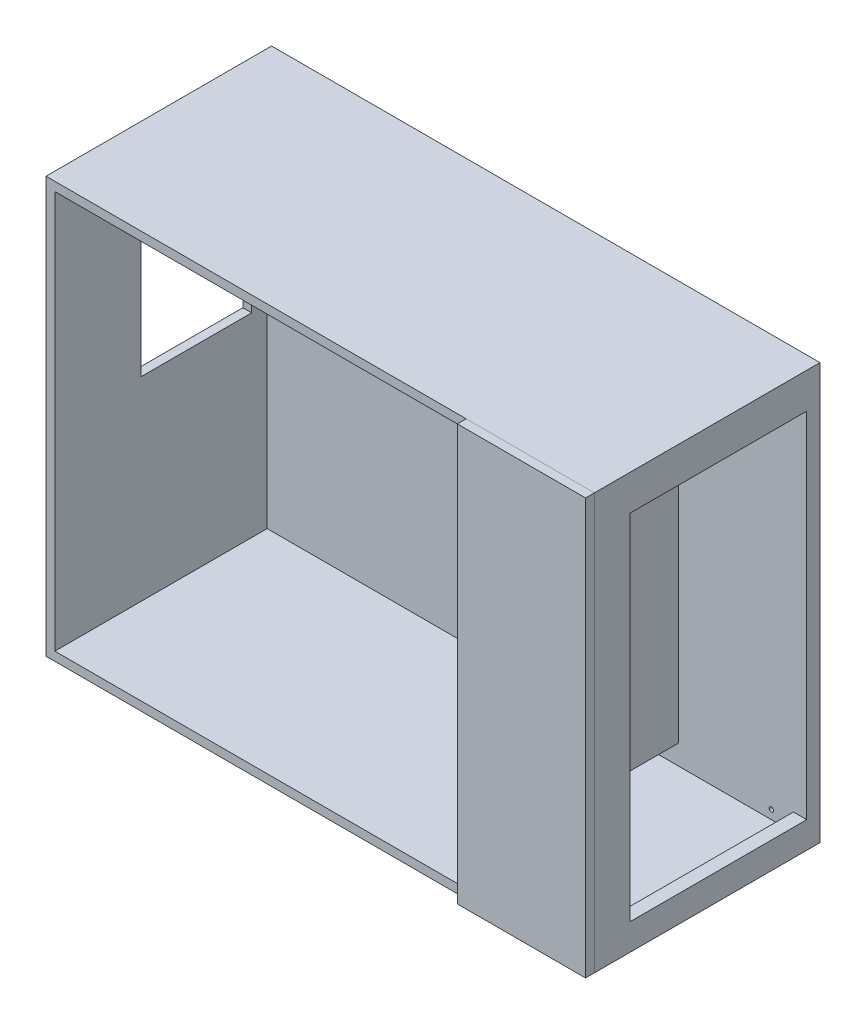
ISO-10303-21;
HEADER;
FILE_DESCRIPTION(('STEP AP214'),'2;1');
FILE_NAME('part.step','',(''),(''),'','','');
FILE_SCHEMA(('AUTOMOTIVE_DESIGN { 1 0 10303 214 1 1 1 1 }'));
ENDSEC;
DATA;
#1=APPLICATION_CONTEXT('core data for automotive mechanical design processes');
#2=APPLICATION_PROTOCOL_DEFINITION('international standard','automotive_design',2000,#1);
#3=PRODUCT_CONTEXT('',#1,'mechanical');
#4=PRODUCT('Part','Part','',(#3));
#5=PRODUCT_RELATED_PRODUCT_CATEGORY('part','',(#4));
#6=PRODUCT_DEFINITION_FORMATION('','',#4);
#7=PRODUCT_DEFINITION_CONTEXT('part definition',#1,'design');
#8=PRODUCT_DEFINITION('design','',#6,#7);
#9=PRODUCT_DEFINITION_SHAPE('','',#8);
#10=(LENGTH_UNIT() NAMED_UNIT(*) SI_UNIT(.MILLI.,.METRE.));
#11=(NAMED_UNIT(*) PLANE_ANGLE_UNIT() SI_UNIT($,.RADIAN.));
#12=(NAMED_UNIT(*) SI_UNIT($,.STERADIAN.) SOLID_ANGLE_UNIT());
#13=UNCERTAINTY_MEASURE_WITH_UNIT(LENGTH_MEASURE(1.E-05),#10,'distance_accuracy_value','');
#14=(GEOMETRIC_REPRESENTATION_CONTEXT(3) GLOBAL_UNCERTAINTY_ASSIGNED_CONTEXT((#13)) GLOBAL_UNIT_ASSIGNED_CONTEXT((#10,
#11,#12)) REPRESENTATION_CONTEXT('',''));
#15=CARTESIAN_POINT('',(0.,0.,0.));
#16=DIRECTION('',(0.,0.,1.));
#17=DIRECTION('',(1.,0.,0.));
#18=AXIS2_PLACEMENT_3D('',#15,#16,#17);
#19=CARTESIAN_POINT('',(300.,1200.,275.));
#20=DIRECTION('',(1.,0.,0.));
#21=DIRECTION('',(0.,1.,0.));
#22=AXIS2_PLACEMENT_3D('',#19,#20,#21);
#23=PLANE('',#22);
#24=DIRECTION('',(0.,-1.,0.));
#25=VECTOR('',#24,1.);
#26=CARTESIAN_POINT('',(300.,1200.,275.));
#27=LINE('',#26,#25);
#28=CARTESIAN_POINT('',(300.,1030.,275.));
#29=VERTEX_POINT('',#28);
#30=CARTESIAN_POINT('',(300.,90.,275.));
#31=VERTEX_POINT('',#30);
#32=EDGE_CURVE('E98',#29,#31,#27,.T.);
#33=ORIENTED_EDGE('',*,*,#32,.F.);
#34=DIRECTION('',(0.,0.,1.));
#35=VECTOR('',#34,1.);
#36=CARTESIAN_POINT('',(300.,1030.,-1165.));
#37=LINE('',#36,#35);
#38=CARTESIAN_POINT('',(300.,1030.,255.));
#39=VERTEX_POINT('',#38);
#40=EDGE_CURVE('E85',#39,#29,#37,.T.);
#41=ORIENTED_EDGE('',*,*,#40,.F.);
#42=DIRECTION('',(0.,-1.,0.));
#43=VECTOR('',#42,1.);
#44=CARTESIAN_POINT('',(300.,1200.,255.));
#45=LINE('',#44,#43);
#46=CARTESIAN_POINT('',(300.,90.,255.));
#47=VERTEX_POINT('',#46);
#48=EDGE_CURVE('E104',#39,#47,#45,.T.);
#49=ORIENTED_EDGE('',*,*,#48,.T.);
#50=DIRECTION('',(0.,0.,1.));
#51=VECTOR('',#50,1.);
#52=CARTESIAN_POINT('',(300.,90.,-1165.));
#53=LINE('',#52,#51);
#54=EDGE_CURVE('E103',#47,#31,#53,.T.);
#55=ORIENTED_EDGE('',*,*,#54,.T.);
#56=EDGE_LOOP('',(#33,#41,#49,#55));
#57=FACE_BOUND('',#56,.T.);
#58=ADVANCED_FACE('F46',(#57),#23,.F.);
#59=CARTESIAN_POINT('',(0.,0.,275.));
#60=DIRECTION('',(0.,0.,-1.));
#61=DIRECTION('',(-1.,0.,0.));
#62=AXIS2_PLACEMENT_3D('',#59,#60,#61);
#63=PLANE('',#62);
#64=DIRECTION('',(0.,-1.,0.));
#65=VECTOR('',#64,1.);
#66=CARTESIAN_POINT('',(590.,0.,275.));
#67=LINE('',#66,#65);
#68=CARTESIAN_POINT('',(590.,1030.,275.));
#69=VERTEX_POINT('',#68);
#70=CARTESIAN_POINT('',(590.,90.,275.));
#71=VERTEX_POINT('',#70);
#72=EDGE_CURVE('E100',#69,#71,#67,.T.);
#73=ORIENTED_EDGE('',*,*,#72,.F.);
#74=DIRECTION('',(1.,0.,0.));
#75=VECTOR('',#74,1.);
#76=CARTESIAN_POINT('',(300.,1030.,275.));
#77=LINE('',#76,#75);
#78=EDGE_CURVE('E60',#29,#69,#77,.T.);
#79=ORIENTED_EDGE('',*,*,#78,.F.);
#80=ORIENTED_EDGE('',*,*,#32,.T.);
#81=DIRECTION('',(-1.,0.,0.));
#82=VECTOR('',#81,1.);
#83=CARTESIAN_POINT('',(300.,90.,275.));
#84=LINE('',#83,#82);
#85=EDGE_CURVE('E112',#71,#31,#84,.T.);
#86=ORIENTED_EDGE('',*,*,#85,.F.);
#87=EDGE_LOOP('',(#73,#79,#80,#86));
#88=FACE_BOUND('',#87,.T.);
#89=ADVANCED_FACE('F96',(#88),#63,.F.);
#90=CARTESIAN_POINT('',(0.,0.,255.));
#91=DIRECTION('',(0.,0.,-1.));
#92=DIRECTION('',(-1.,0.,0.));
#93=AXIS2_PLACEMENT_3D('',#90,#91,#92);
#94=PLANE('',#93);
#95=DIRECTION('',(-1.,0.,0.));
#96=VECTOR('',#95,1.);
#97=CARTESIAN_POINT('',(-1.57728236601919E-12,1030.,255.));
#98=LINE('',#97,#96);
#99=CARTESIAN_POINT('',(590.,1030.,255.));
#100=VERTEX_POINT('',#99);
#101=EDGE_CURVE('E88',#100,#39,#98,.T.);
#102=ORIENTED_EDGE('',*,*,#101,.F.);
#103=DIRECTION('',(0.,1.,0.));
#104=VECTOR('',#103,1.);
#105=CARTESIAN_POINT('',(590.,0.,255.));
#106=LINE('',#105,#104);
#107=CARTESIAN_POINT('',(590.,90.,255.));
#108=VERTEX_POINT('',#107);
#109=EDGE_CURVE('E53',#108,#100,#106,.T.);
#110=ORIENTED_EDGE('',*,*,#109,.F.);
#111=DIRECTION('',(1.,0.,0.));
#112=VECTOR('',#111,1.);
#113=CARTESIAN_POINT('',(0.,90.,255.));
#114=LINE('',#113,#112);
#115=EDGE_CURVE('E68',#47,#108,#114,.T.);
#116=ORIENTED_EDGE('',*,*,#115,.F.);
#117=ORIENTED_EDGE('',*,*,#48,.F.);
#118=EDGE_LOOP('',(#102,#110,#116,#117));
#119=FACE_BOUND('',#118,.T.);
#120=ADVANCED_FACE('F119',(#119),#94,.T.);
#121=CARTESIAN_POINT('',(590.,0.,-1165.));
#122=DIRECTION('',(-1.,0.,0.));
#123=DIRECTION('',(0.,-1.,0.));
#124=AXIS2_PLACEMENT_3D('',#121,#122,#123);
#125=PLANE('',#124);
#126=ORIENTED_EDGE('',*,*,#109,.T.);
#127=DIRECTION('',(0.,0.,1.));
#128=VECTOR('',#127,1.);
#129=CARTESIAN_POINT('',(590.,1030.,-1165.));
#130=LINE('',#129,#128);
#131=EDGE_CURVE('E92',#100,#69,#130,.T.);
#132=ORIENTED_EDGE('',*,*,#131,.T.);
#133=ORIENTED_EDGE('',*,*,#72,.T.);
#134=DIRECTION('',(0.,0.,-1.));
#135=VECTOR('',#134,1.);
#136=CARTESIAN_POINT('',(590.,90.,-1165.));
#137=LINE('',#136,#135);
#138=EDGE_CURVE('E12',#71,#108,#137,.T.);
#139=ORIENTED_EDGE('',*,*,#138,.T.);
#140=EDGE_LOOP('',(#126,#132,#133,#139));
#141=FACE_BOUND('',#140,.T.);
#142=ADVANCED_FACE('F116',(#141),#125,.F.);
#143=CARTESIAN_POINT('',(300.,90.,-1165.));
#144=DIRECTION('',(0.,1.,0.));
#145=DIRECTION('',(0.,0.,1.));
#146=AXIS2_PLACEMENT_3D('',#143,#144,#145);
#147=PLANE('',#146);
#148=ORIENTED_EDGE('',*,*,#115,.T.);
#149=ORIENTED_EDGE('',*,*,#138,.F.);
#150=ORIENTED_EDGE('',*,*,#85,.T.);
#151=ORIENTED_EDGE('',*,*,#54,.F.);
#152=EDGE_LOOP('',(#148,#149,#150,#151));
#153=FACE_BOUND('',#152,.T.);
#154=ADVANCED_FACE('F120',(#153),#147,.F.);
#155=CARTESIAN_POINT('',(300.,1030.,-1165.));
#156=DIRECTION('',(0.,-1.,0.));
#157=DIRECTION('',(1.,0.,0.));
#158=AXIS2_PLACEMENT_3D('',#155,#156,#157);
#159=PLANE('',#158);
#160=ORIENTED_EDGE('',*,*,#101,.T.);
#161=ORIENTED_EDGE('',*,*,#40,.T.);
#162=ORIENTED_EDGE('',*,*,#78,.T.);
#163=ORIENTED_EDGE('',*,*,#131,.F.);
#164=EDGE_LOOP('',(#160,#161,#162,#163));
#165=FACE_BOUND('',#164,.T.);
#166=ADVANCED_FACE('F86',(#165),#159,.F.);
#167=CLOSED_SHELL('',(#58,#89,#120,#142,#154,#166));
#168=MANIFOLD_SOLID_BREP('B2',#167);
#169=CARTESIAN_POINT('',(-650.,1200.,255.));
#170=DIRECTION('',(1.,0.,0.));
#171=DIRECTION('',(0.,0.,-1.));
#172=AXIS2_PLACEMENT_3D('',#169,#170,#171);
#173=PLANE('',#172);
#174=DIRECTION('',(0.,0.,-1.));
#175=VECTOR('',#174,1.);
#176=CARTESIAN_POINT('',(-650.,950.,59.9999999999999));
#177=LINE('',#176,#175);
#178=CARTESIAN_POINT('',(-650.,950.,59.9999999999999));
#179=VERTEX_POINT('',#178);
#180=CARTESIAN_POINT('',(-650.,950.,-190.));
#181=VERTEX_POINT('',#180);
#182=EDGE_CURVE('E442',#179,#181,#177,.T.);
#183=ORIENTED_EDGE('',*,*,#182,.F.);
#184=DIRECTION('',(0.,1.,0.));
#185=VECTOR('',#184,1.);
#186=CARTESIAN_POINT('',(-650.,950.,59.9999999999999));
#187=LINE('',#186,#185);
#188=CARTESIAN_POINT('',(-650.,550.,60.));
#189=VERTEX_POINT('',#188);
#190=EDGE_CURVE('E435',#189,#179,#187,.T.);
#191=ORIENTED_EDGE('',*,*,#190,.F.);
#192=DIRECTION('',(0.,0.,1.));
#193=VECTOR('',#192,1.);
#194=CARTESIAN_POINT('',(-650.,550.,60.));
#195=LINE('',#194,#193);
#196=CARTESIAN_POINT('',(-650.,550.,-190.));
#197=VERTEX_POINT('',#196);
#198=EDGE_CURVE('E448',#197,#189,#195,.T.);
#199=ORIENTED_EDGE('',*,*,#198,.F.);
#200=DIRECTION('',(0.,-1.,0.));
#201=VECTOR('',#200,1.);
#202=CARTESIAN_POINT('',(-650.,950.,-190.));
#203=LINE('',#202,#201);
#204=EDGE_CURVE('E445',#181,#197,#203,.T.);
#205=ORIENTED_EDGE('',*,*,#204,.F.);
#206=EDGE_LOOP('',(#183,#191,#199,#205));
#207=FACE_BOUND('',#206,.T.);
#208=DIRECTION('',(0.,-1.,0.));
#209=VECTOR('',#208,1.);
#210=CARTESIAN_POINT('',(-650.,1200.,255.));
#211=LINE('',#210,#209);
#212=CARTESIAN_POINT('',(-650.,1030.,255.));
#213=VERTEX_POINT('',#212);
#214=CARTESIAN_POINT('',(-650.,90.,255.));
#215=VERTEX_POINT('',#214);
#216=EDGE_CURVE('E331',#213,#215,#211,.T.);
#217=ORIENTED_EDGE('',*,*,#216,.F.);
#218=DIRECTION('',(0.,0.,1.));
#219=VECTOR('',#218,1.);
#220=CARTESIAN_POINT('',(-650.,1030.,-1185.));
#221=LINE('',#220,#219);
#222=CARTESIAN_POINT('',(-650.,1030.,-255.));
#223=VERTEX_POINT('',#222);
#224=EDGE_CURVE('E319',#223,#213,#221,.T.);
#225=ORIENTED_EDGE('',*,*,#224,.F.);
#226=DIRECTION('',(0.,-1.,0.));
#227=VECTOR('',#226,1.);
#228=CARTESIAN_POINT('',(-650.,1200.,-255.));
#229=LINE('',#228,#227);
#230=CARTESIAN_POINT('',(-650.,90.0000000000001,-255.));
#231=VERTEX_POINT('',#230);
#232=EDGE_CURVE('E340',#223,#231,#229,.T.);
#233=ORIENTED_EDGE('',*,*,#232,.T.);
#234=DIRECTION('',(0.,0.,-1.));
#235=VECTOR('',#234,1.);
#236=CARTESIAN_POINT('',(-650.,90.,-255.));
#237=LINE('',#236,#235);
#238=EDGE_CURVE('E338',#215,#231,#237,.T.);
#239=ORIENTED_EDGE('',*,*,#238,.F.);
#240=EDGE_LOOP('',(#217,#225,#233,#239));
#241=FACE_BOUND('',#240,.T.);
#242=ADVANCED_FACE('F174',(#207,#241),#173,.F.);
#243=CARTESIAN_POINT('',(-650.,1200.,255.));
#244=DIRECTION('',(0.,0.,-1.));
#245=DIRECTION('',(-1.,0.,0.));
#246=AXIS2_PLACEMENT_3D('',#243,#244,#245);
#247=PLANE('',#246);
#248=DIRECTION('',(1.,0.,0.));
#249=VECTOR('',#248,1.);
#250=CARTESIAN_POINT('',(560.,110.,255.));
#251=LINE('',#250,#249);
#252=CARTESIAN_POINT('',(300.,110.,255.));
#253=VERTEX_POINT('',#252);
#254=CARTESIAN_POINT('',(560.,110.,255.));
#255=VERTEX_POINT('',#254);
#256=EDGE_CURVE('E425',#253,#255,#251,.T.);
#257=ORIENTED_EDGE('',*,*,#256,.F.);
#258=DIRECTION('',(0.,-1.,0.));
#259=VECTOR('',#258,1.);
#260=CARTESIAN_POINT('',(300.,110.,255.));
#261=LINE('',#260,#259);
#262=CARTESIAN_POINT('',(300.,1010.,255.));
#263=VERTEX_POINT('',#262);
#264=EDGE_CURVE('E410',#263,#253,#261,.T.);
#265=ORIENTED_EDGE('',*,*,#264,.F.);
#266=DIRECTION('',(-1.,0.,0.));
#267=VECTOR('',#266,1.);
#268=CARTESIAN_POINT('',(560.,1010.,255.));
#269=LINE('',#268,#267);
#270=CARTESIAN_POINT('',(560.,1010.,255.));
#271=VERTEX_POINT('',#270);
#272=EDGE_CURVE('E415',#271,#263,#269,.T.);
#273=ORIENTED_EDGE('',*,*,#272,.F.);
#274=DIRECTION('',(0.,1.,0.));
#275=VECTOR('',#274,1.);
#276=CARTESIAN_POINT('',(560.,110.,255.));
#277=LINE('',#276,#275);
#278=EDGE_CURVE('E428',#255,#271,#277,.T.);
#279=ORIENTED_EDGE('',*,*,#278,.F.);
#280=EDGE_LOOP('',(#257,#265,#273,#279));
#281=FACE_BOUND('',#280,.T.);
#282=DIRECTION('',(0.,1.,0.));
#283=VECTOR('',#282,1.);
#284=CARTESIAN_POINT('',(280.,0.,255.));
#285=LINE('',#284,#283);
#286=CARTESIAN_POINT('',(280.,110.,255.));
#287=VERTEX_POINT('',#286);
#288=CARTESIAN_POINT('',(280.,1010.,255.));
#289=VERTEX_POINT('',#288);
#290=EDGE_CURVE('E475',#287,#289,#285,.T.);
#291=ORIENTED_EDGE('',*,*,#290,.F.);
#292=DIRECTION('',(1.,0.,0.));
#293=VECTOR('',#292,1.);
#294=CARTESIAN_POINT('',(0.,110.,255.));
#295=LINE('',#294,#293);
#296=CARTESIAN_POINT('',(-630.,110.,255.));
#297=VERTEX_POINT('',#296);
#298=EDGE_CURVE('E454',#297,#287,#295,.T.);
#299=ORIENTED_EDGE('',*,*,#298,.F.);
#300=DIRECTION('',(0.,-1.,0.));
#301=VECTOR('',#300,1.);
#302=CARTESIAN_POINT('',(-630.,0.,255.));
#303=LINE('',#302,#301);
#304=CARTESIAN_POINT('',(-630.,1010.,255.));
#305=VERTEX_POINT('',#304);
#306=EDGE_CURVE('E464',#305,#297,#303,.T.);
#307=ORIENTED_EDGE('',*,*,#306,.F.);
#308=DIRECTION('',(1.,0.,0.));
#309=VECTOR('',#308,1.);
#310=CARTESIAN_POINT('',(0.,1010.,255.));
#311=LINE('',#310,#309);
#312=EDGE_CURVE('E478',#305,#289,#311,.T.);
#313=ORIENTED_EDGE('',*,*,#312,.T.);
#314=EDGE_LOOP('',(#291,#299,#307,#313));
#315=FACE_BOUND('',#314,.T.);
#316=DIRECTION('',(0.,1.,0.));
#317=VECTOR('',#316,1.);
#318=CARTESIAN_POINT('',(590.,1200.,255.));
#319=LINE('',#318,#317);
#320=CARTESIAN_POINT('',(590.,90.,255.));
#321=VERTEX_POINT('',#320);
#322=CARTESIAN_POINT('',(590.,1030.,255.));
#323=VERTEX_POINT('',#322);
#324=EDGE_CURVE('E333',#321,#323,#319,.T.);
#325=ORIENTED_EDGE('',*,*,#324,.T.);
#326=DIRECTION('',(1.,0.,0.));
#327=VECTOR('',#326,1.);
#328=CARTESIAN_POINT('',(-650.,1030.,255.));
#329=LINE('',#328,#327);
#330=EDGE_CURVE('E188',#213,#323,#329,.T.);
#331=ORIENTED_EDGE('',*,*,#330,.F.);
#332=ORIENTED_EDGE('',*,*,#216,.T.);
#333=DIRECTION('',(-1.,0.,0.));
#334=VECTOR('',#333,1.);
#335=CARTESIAN_POINT('',(790.000000000001,90.,255.));
#336=LINE('',#335,#334);
#337=EDGE_CURVE('E364',#321,#215,#336,.T.);
#338=ORIENTED_EDGE('',*,*,#337,.F.);
#339=EDGE_LOOP('',(#325,#331,#332,#338));
#340=FACE_BOUND('',#339,.T.);
#341=ADVANCED_FACE('F329',(#281,#315,#340),#247,.F.);
#342=CARTESIAN_POINT('',(-650.,1200.,-255.));
#343=DIRECTION('',(0.,0.,1.));
#344=DIRECTION('',(1.,0.,0.));
#345=AXIS2_PLACEMENT_3D('',#342,#343,#344);
#346=PLANE('',#345);
#347=CARTESIAN_POINT('',(510.,130.,-255.));
#348=DIRECTION('',(0.,0.,-1.));
#349=DIRECTION('',(-1.,0.,0.));
#350=AXIS2_PLACEMENT_3D('',#347,#348,#349);
#351=CIRCLE('',#350,5.00000000000005);
#352=CARTESIAN_POINT('',(505.,130.,-255.));
#353=VERTEX_POINT('',#352);
#354=EDGE_CURVE('E586',#353,#353,#351,.T.);
#355=ORIENTED_EDGE('',*,*,#354,.F.);
#356=EDGE_LOOP('',(#355));
#357=FACE_BOUND('',#356,.T.);
#358=ORIENTED_EDGE('',*,*,#232,.F.);
#359=DIRECTION('',(1.,0.,0.));
#360=VECTOR('',#359,1.);
#361=CARTESIAN_POINT('',(-650.,1030.,-255.));
#362=LINE('',#361,#360);
#363=CARTESIAN_POINT('',(590.,1030.,-255.));
#364=VERTEX_POINT('',#363);
#365=EDGE_CURVE('E322',#223,#364,#362,.T.);
#366=ORIENTED_EDGE('',*,*,#365,.T.);
#367=DIRECTION('',(0.,-1.,0.));
#368=VECTOR('',#367,1.);
#369=CARTESIAN_POINT('',(590.,1200.,-255.));
#370=LINE('',#369,#368);
#371=CARTESIAN_POINT('',(590.,90.,-255.));
#372=VERTEX_POINT('',#371);
#373=EDGE_CURVE('E592',#364,#372,#370,.T.);
#374=ORIENTED_EDGE('',*,*,#373,.T.);
#375=DIRECTION('',(-1.,0.,0.));
#376=VECTOR('',#375,1.);
#377=CARTESIAN_POINT('',(790.000000000001,90.,-255.));
#378=LINE('',#377,#376);
#379=EDGE_CURVE('E366',#372,#231,#378,.T.);
#380=ORIENTED_EDGE('',*,*,#379,.T.);
#381=EDGE_LOOP('',(#358,#366,#374,#380));
#382=FACE_BOUND('',#381,.T.);
#383=ADVANCED_FACE('F541',(#357,#382),#346,.F.);
#384=CARTESIAN_POINT('',(0.,110.,-225.));
#385=DIRECTION('',(0.,-1.,0.));
#386=DIRECTION('',(0.,0.,-1.));
#387=AXIS2_PLACEMENT_3D('',#384,#385,#386);
#388=PLANE('',#387);
#389=ORIENTED_EDGE('',*,*,#298,.T.);
#390=DIRECTION('',(0.,0.,1.));
#391=VECTOR('',#390,1.);
#392=CARTESIAN_POINT('',(280.,110.,-225.));
#393=LINE('',#392,#391);
#394=CARTESIAN_POINT('',(280.,110.,-94.9999999999996));
#395=VERTEX_POINT('',#394);
#396=EDGE_CURVE('E472',#395,#287,#393,.T.);
#397=ORIENTED_EDGE('',*,*,#396,.F.);
#398=DIRECTION('',(-1.,0.,0.));
#399=VECTOR('',#398,1.);
#400=CARTESIAN_POINT('',(510.,110.,-94.9999999999996));
#401=LINE('',#400,#399);
#402=CARTESIAN_POINT('',(300.,110.,-94.9999999999996));
#403=VERTEX_POINT('',#402);
#404=EDGE_CURVE('E380',#403,#395,#401,.T.);
#405=ORIENTED_EDGE('',*,*,#404,.F.);
#406=DIRECTION('',(0.,0.,1.));
#407=VECTOR('',#406,1.);
#408=CARTESIAN_POINT('',(300.,110.,-225.));
#409=LINE('',#408,#407);
#410=EDGE_CURVE('E422',#403,#253,#409,.T.);
#411=ORIENTED_EDGE('',*,*,#410,.T.);
#412=ORIENTED_EDGE('',*,*,#256,.T.);
#413=DIRECTION('',(0.,0.,1.));
#414=VECTOR('',#413,1.);
#415=CARTESIAN_POINT('',(560.,110.,-225.));
#416=LINE('',#415,#414);
#417=CARTESIAN_POINT('',(560.,110.,-225.));
#418=VERTEX_POINT('',#417);
#419=EDGE_CURVE('E438',#418,#255,#416,.T.);
#420=ORIENTED_EDGE('',*,*,#419,.F.);
#421=DIRECTION('',(1.,0.,0.));
#422=VECTOR('',#421,1.);
#423=CARTESIAN_POINT('',(0.,110.,-225.));
#424=LINE('',#423,#422);
#425=CARTESIAN_POINT('',(-630.,110.,-225.));
#426=VERTEX_POINT('',#425);
#427=EDGE_CURVE('E461',#426,#418,#424,.T.);
#428=ORIENTED_EDGE('',*,*,#427,.F.);
#429=DIRECTION('',(0.,0.,1.));
#430=VECTOR('',#429,1.);
#431=CARTESIAN_POINT('',(-630.,110.,-225.));
#432=LINE('',#431,#430);
#433=EDGE_CURVE('E345',#426,#297,#432,.T.);
#434=ORIENTED_EDGE('',*,*,#433,.T.);
#435=EDGE_LOOP('',(#389,#397,#405,#411,#412,#420,#428,#434));
#436=FACE_BOUND('',#435,.T.);
#437=ADVANCED_FACE('F497',(#436),#388,.F.);
#438=CARTESIAN_POINT('',(-630.,0.,-225.));
#439=DIRECTION('',(-1.,0.,0.));
#440=DIRECTION('',(0.,-1.,0.));
#441=AXIS2_PLACEMENT_3D('',#438,#439,#440);
#442=PLANE('',#441);
#443=DIRECTION('',(0.,0.,1.));
#444=VECTOR('',#443,1.);
#445=CARTESIAN_POINT('',(-630.,550.,-225.));
#446=LINE('',#445,#444);
#447=CARTESIAN_POINT('',(-630.,550.,-190.));
#448=VERTEX_POINT('',#447);
#449=CARTESIAN_POINT('',(-630.,550.,60.));
#450=VERTEX_POINT('',#449);
#451=EDGE_CURVE('E351',#448,#450,#446,.T.);
#452=ORIENTED_EDGE('',*,*,#451,.T.);
#453=DIRECTION('',(0.,1.,0.));
#454=VECTOR('',#453,1.);
#455=CARTESIAN_POINT('',(-630.,0.,60.0000000000001));
#456=LINE('',#455,#454);
#457=CARTESIAN_POINT('',(-630.,950.,59.9999999999999));
#458=VERTEX_POINT('',#457);
#459=EDGE_CURVE('E354',#450,#458,#456,.T.);
#460=ORIENTED_EDGE('',*,*,#459,.T.);
#461=DIRECTION('',(0.,0.,-1.));
#462=VECTOR('',#461,1.);
#463=CARTESIAN_POINT('',(-630.,950.,-225.));
#464=LINE('',#463,#462);
#465=CARTESIAN_POINT('',(-630.,950.,-190.));
#466=VERTEX_POINT('',#465);
#467=EDGE_CURVE('E339',#458,#466,#464,.T.);
#468=ORIENTED_EDGE('',*,*,#467,.T.);
#469=DIRECTION('',(0.,-1.,0.));
#470=VECTOR('',#469,1.);
#471=CARTESIAN_POINT('',(-630.,0.,-190.));
#472=LINE('',#471,#470);
#473=EDGE_CURVE('E343',#466,#448,#472,.T.);
#474=ORIENTED_EDGE('',*,*,#473,.T.);
#475=EDGE_LOOP('',(#452,#460,#468,#474));
#476=FACE_BOUND('',#475,.T.);
#477=ORIENTED_EDGE('',*,*,#306,.T.);
#478=ORIENTED_EDGE('',*,*,#433,.F.);
#479=DIRECTION('',(0.,-1.,0.));
#480=VECTOR('',#479,1.);
#481=CARTESIAN_POINT('',(-630.,0.,-225.));
#482=LINE('',#481,#480);
#483=CARTESIAN_POINT('',(-630.,1010.,-225.));
#484=VERTEX_POINT('',#483);
#485=EDGE_CURVE('E469',#484,#426,#482,.T.);
#486=ORIENTED_EDGE('',*,*,#485,.F.);
#487=DIRECTION('',(0.,0.,1.));
#488=VECTOR('',#487,1.);
#489=CARTESIAN_POINT('',(-630.,1010.,-225.));
#490=LINE('',#489,#488);
#491=EDGE_CURVE('E484',#484,#305,#490,.T.);
#492=ORIENTED_EDGE('',*,*,#491,.T.);
#493=EDGE_LOOP('',(#477,#478,#486,#492));
#494=FACE_BOUND('',#493,.T.);
#495=ADVANCED_FACE('F532',(#476,#494),#442,.F.);
#496=CARTESIAN_POINT('',(0.,1010.,-225.));
#497=DIRECTION('',(0.,-1.,0.));
#498=DIRECTION('',(0.,0.,-1.));
#499=AXIS2_PLACEMENT_3D('',#496,#497,#498);
#500=PLANE('',#499);
#501=ORIENTED_EDGE('',*,*,#312,.F.);
#502=ORIENTED_EDGE('',*,*,#491,.F.);
#503=DIRECTION('',(1.,0.,0.));
#504=VECTOR('',#503,1.);
#505=CARTESIAN_POINT('',(0.,1010.,-225.));
#506=LINE('',#505,#504);
#507=CARTESIAN_POINT('',(280.,1010.,-225.));
#508=VERTEX_POINT('',#507);
#509=EDGE_CURVE('E466',#484,#508,#506,.T.);
#510=ORIENTED_EDGE('',*,*,#509,.T.);
#511=DIRECTION('',(0.,0.,1.));
#512=VECTOR('',#511,1.);
#513=CARTESIAN_POINT('',(280.,1010.,-225.));
#514=LINE('',#513,#512);
#515=EDGE_CURVE('E486',#508,#289,#514,.T.);
#516=ORIENTED_EDGE('',*,*,#515,.T.);
#517=EDGE_LOOP('',(#501,#502,#510,#516));
#518=FACE_BOUND('',#517,.T.);
#519=ADVANCED_FACE('F503',(#518),#500,.T.);
#520=CARTESIAN_POINT('',(280.,0.,-225.));
#521=DIRECTION('',(1.,0.,0.));
#522=DIRECTION('',(0.,0.,-1.));
#523=AXIS2_PLACEMENT_3D('',#520,#521,#522);
#524=PLANE('',#523);
#525=DIRECTION('',(0.,0.,-1.));
#526=VECTOR('',#525,1.);
#527=CARTESIAN_POINT('',(280.,155.,-225.));
#528=LINE('',#527,#526);
#529=CARTESIAN_POINT('',(280.,155.,-94.9999999999996));
#530=VERTEX_POINT('',#529);
#531=CARTESIAN_POINT('',(280.,155.,-225.));
#532=VERTEX_POINT('',#531);
#533=EDGE_CURVE('E377',#530,#532,#528,.T.);
#534=ORIENTED_EDGE('',*,*,#533,.F.);
#535=DIRECTION('',(0.,1.,0.));
#536=VECTOR('',#535,1.);
#537=CARTESIAN_POINT('',(280.,110.,-94.9999999999996));
#538=LINE('',#537,#536);
#539=EDGE_CURVE('E370',#395,#530,#538,.T.);
#540=ORIENTED_EDGE('',*,*,#539,.F.);
#541=ORIENTED_EDGE('',*,*,#396,.T.);
#542=ORIENTED_EDGE('',*,*,#290,.T.);
#543=ORIENTED_EDGE('',*,*,#515,.F.);
#544=DIRECTION('',(0.,1.,0.));
#545=VECTOR('',#544,1.);
#546=CARTESIAN_POINT('',(280.,0.,-225.));
#547=LINE('',#546,#545);
#548=EDGE_CURVE('E463',#532,#508,#547,.T.);
#549=ORIENTED_EDGE('',*,*,#548,.F.);
#550=EDGE_LOOP('',(#534,#540,#541,#542,#543,#549));
#551=FACE_BOUND('',#550,.T.);
#552=ADVANCED_FACE('F491',(#551),#524,.F.);
#553=CARTESIAN_POINT('',(0.,0.,-225.));
#554=DIRECTION('',(0.,0.,1.));
#555=DIRECTION('',(1.,0.,0.));
#556=AXIS2_PLACEMENT_3D('',#553,#554,#555);
#557=PLANE('',#556);
#558=CARTESIAN_POINT('',(510.,130.,-225.));
#559=DIRECTION('',(0.,0.,-1.));
#560=DIRECTION('',(-1.,0.,0.));
#561=AXIS2_PLACEMENT_3D('',#558,#559,#560);
#562=CIRCLE('',#561,5.00000000000005);
#563=CARTESIAN_POINT('',(505.,130.,-225.));
#564=VERTEX_POINT('',#563);
#565=EDGE_CURVE('E334',#564,#564,#562,.T.);
#566=ORIENTED_EDGE('',*,*,#565,.T.);
#567=EDGE_LOOP('',(#566));
#568=FACE_BOUND('',#567,.T.);
#569=DIRECTION('',(0.,-1.,0.));
#570=VECTOR('',#569,1.);
#571=CARTESIAN_POINT('',(590.,0.,-225.));
#572=LINE('',#571,#570);
#573=CARTESIAN_POINT('',(590.,950.,-225.));
#574=VERTEX_POINT('',#573);
#575=CARTESIAN_POINT('',(590.,150.,-225.));
#576=VERTEX_POINT('',#575);
#577=EDGE_CURVE('E598',#574,#576,#572,.T.);
#578=ORIENTED_EDGE('',*,*,#577,.F.);
#579=DIRECTION('',(1.,0.,0.));
#580=VECTOR('',#579,1.);
#581=CARTESIAN_POINT('',(330.,950.,-225.));
#582=LINE('',#581,#580);
#583=CARTESIAN_POINT('',(560.,950.,-225.));
#584=VERTEX_POINT('',#583);
#585=EDGE_CURVE('E392',#584,#574,#582,.T.);
#586=ORIENTED_EDGE('',*,*,#585,.F.);
#587=DIRECTION('',(0.,1.,0.));
#588=VECTOR('',#587,1.);
#589=CARTESIAN_POINT('',(560.,110.,-225.));
#590=LINE('',#589,#588);
#591=CARTESIAN_POINT('',(560.,1010.,-225.));
#592=VERTEX_POINT('',#591);
#593=EDGE_CURVE('E414',#584,#592,#590,.T.);
#594=ORIENTED_EDGE('',*,*,#593,.T.);
#595=DIRECTION('',(-1.,0.,0.));
#596=VECTOR('',#595,1.);
#597=CARTESIAN_POINT('',(560.,1010.,-225.));
#598=LINE('',#597,#596);
#599=CARTESIAN_POINT('',(300.,1010.,-225.));
#600=VERTEX_POINT('',#599);
#601=EDGE_CURVE('E419',#592,#600,#598,.T.);
#602=ORIENTED_EDGE('',*,*,#601,.T.);
#603=DIRECTION('',(0.,-1.,0.));
#604=VECTOR('',#603,1.);
#605=CARTESIAN_POINT('',(300.,110.,-225.));
#606=LINE('',#605,#604);
#607=CARTESIAN_POINT('',(300.,155.,-225.));
#608=VERTEX_POINT('',#607);
#609=EDGE_CURVE('E411',#600,#608,#606,.T.);
#610=ORIENTED_EDGE('',*,*,#609,.T.);
#611=DIRECTION('',(-1.,0.,0.));
#612=VECTOR('',#611,1.);
#613=CARTESIAN_POINT('',(510.,155.,-225.));
#614=LINE('',#613,#612);
#615=EDGE_CURVE('E383',#608,#532,#614,.T.);
#616=ORIENTED_EDGE('',*,*,#615,.T.);
#617=ORIENTED_EDGE('',*,*,#548,.T.);
#618=ORIENTED_EDGE('',*,*,#509,.F.);
#619=ORIENTED_EDGE('',*,*,#485,.T.);
#620=ORIENTED_EDGE('',*,*,#427,.T.);
#621=CARTESIAN_POINT('',(560.,150.,-225.));
#622=VERTEX_POINT('',#621);
#623=EDGE_CURVE('E416',#418,#622,#590,.T.);
#624=ORIENTED_EDGE('',*,*,#623,.T.);
#625=DIRECTION('',(1.,0.,0.));
#626=VECTOR('',#625,1.);
#627=CARTESIAN_POINT('',(330.,150.,-225.));
#628=LINE('',#627,#626);
#629=EDGE_CURVE('E393',#622,#576,#628,.T.);
#630=ORIENTED_EDGE('',*,*,#629,.T.);
#631=EDGE_LOOP('',(#578,#586,#594,#602,#610,#616,#617,#618,#619,#620,#624,#630));
#632=FACE_BOUND('',#631,.T.);
#633=ADVANCED_FACE('F508',(#568,#632),#557,.T.);
#634=CARTESIAN_POINT('',(-580.,950.,59.9999999999999));
#635=DIRECTION('',(0.,0.,1.));
#636=DIRECTION('',(1.,0.,0.));
#637=AXIS2_PLACEMENT_3D('',#634,#635,#636);
#638=PLANE('',#637);
#639=DIRECTION('',(-1.,0.,0.));
#640=VECTOR('',#639,1.);
#641=CARTESIAN_POINT('',(-580.,550.,60.));
#642=LINE('',#641,#640);
#643=EDGE_CURVE('E452',#450,#189,#642,.T.);
#644=ORIENTED_EDGE('',*,*,#643,.T.);
#645=ORIENTED_EDGE('',*,*,#190,.T.);
#646=DIRECTION('',(-1.,0.,0.));
#647=VECTOR('',#646,1.);
#648=CARTESIAN_POINT('',(-580.,950.,59.9999999999999));
#649=LINE('',#648,#647);
#650=EDGE_CURVE('E451',#458,#179,#649,.T.);
#651=ORIENTED_EDGE('',*,*,#650,.F.);
#652=ORIENTED_EDGE('',*,*,#459,.F.);
#653=EDGE_LOOP('',(#644,#645,#651,#652));
#654=FACE_BOUND('',#653,.T.);
#655=ADVANCED_FACE('F558',(#654),#638,.F.);
#656=CARTESIAN_POINT('',(-580.,550.,60.));
#657=DIRECTION('',(0.,-1.,0.));
#658=DIRECTION('',(0.,0.,-1.));
#659=AXIS2_PLACEMENT_3D('',#656,#657,#658);
#660=PLANE('',#659);
#661=DIRECTION('',(-1.,0.,0.));
#662=VECTOR('',#661,1.);
#663=CARTESIAN_POINT('',(-580.,550.,-190.));
#664=LINE('',#663,#662);
#665=EDGE_CURVE('E455',#448,#197,#664,.T.);
#666=ORIENTED_EDGE('',*,*,#665,.T.);
#667=ORIENTED_EDGE('',*,*,#198,.T.);
#668=ORIENTED_EDGE('',*,*,#643,.F.);
#669=ORIENTED_EDGE('',*,*,#451,.F.);
#670=EDGE_LOOP('',(#666,#667,#668,#669));
#671=FACE_BOUND('',#670,.T.);
#672=ADVANCED_FACE('F562',(#671),#660,.F.);
#673=CARTESIAN_POINT('',(-580.,950.,-190.));
#674=DIRECTION('',(0.,0.,-1.));
#675=DIRECTION('',(0.,1.,0.));
#676=AXIS2_PLACEMENT_3D('',#673,#674,#675);
#677=PLANE('',#676);
#678=DIRECTION('',(-1.,0.,0.));
#679=VECTOR('',#678,1.);
#680=CARTESIAN_POINT('',(-580.,950.,-190.));
#681=LINE('',#680,#679);
#682=EDGE_CURVE('E457',#466,#181,#681,.T.);
#683=ORIENTED_EDGE('',*,*,#682,.T.);
#684=ORIENTED_EDGE('',*,*,#204,.T.);
#685=ORIENTED_EDGE('',*,*,#665,.F.);
#686=ORIENTED_EDGE('',*,*,#473,.F.);
#687=EDGE_LOOP('',(#683,#684,#685,#686));
#688=FACE_BOUND('',#687,.T.);
#689=ADVANCED_FACE('F564',(#688),#677,.F.);
#690=CARTESIAN_POINT('',(-580.,950.,59.9999999999999));
#691=DIRECTION('',(0.,1.,0.));
#692=DIRECTION('',(0.,0.,1.));
#693=AXIS2_PLACEMENT_3D('',#690,#691,#692);
#694=PLANE('',#693);
#695=ORIENTED_EDGE('',*,*,#650,.T.);
#696=ORIENTED_EDGE('',*,*,#182,.T.);
#697=ORIENTED_EDGE('',*,*,#682,.F.);
#698=ORIENTED_EDGE('',*,*,#467,.F.);
#699=EDGE_LOOP('',(#695,#696,#697,#698));
#700=FACE_BOUND('',#699,.T.);
#701=ADVANCED_FACE('F554',(#700),#694,.F.);
#702=CARTESIAN_POINT('',(300.,110.,-225.));
#703=DIRECTION('',(-1.,0.,0.));
#704=DIRECTION('',(0.,0.,1.));
#705=AXIS2_PLACEMENT_3D('',#702,#703,#704);
#706=PLANE('',#705);
#707=ORIENTED_EDGE('',*,*,#410,.F.);
#708=DIRECTION('',(0.,1.,0.));
#709=VECTOR('',#708,1.);
#710=CARTESIAN_POINT('',(300.,110.,-94.9999999999996));
#711=LINE('',#710,#709);
#712=CARTESIAN_POINT('',(300.,155.,-94.9999999999996));
#713=VERTEX_POINT('',#712);
#714=EDGE_CURVE('E389',#403,#713,#711,.T.);
#715=ORIENTED_EDGE('',*,*,#714,.T.);
#716=DIRECTION('',(0.,0.,-1.));
#717=VECTOR('',#716,1.);
#718=CARTESIAN_POINT('',(300.,155.,-225.));
#719=LINE('',#718,#717);
#720=EDGE_CURVE('E382',#713,#608,#719,.T.);
#721=ORIENTED_EDGE('',*,*,#720,.T.);
#722=ORIENTED_EDGE('',*,*,#609,.F.);
#723=DIRECTION('',(0.,0.,1.));
#724=VECTOR('',#723,1.);
#725=CARTESIAN_POINT('',(300.,1010.,-225.));
#726=LINE('',#725,#724);
#727=EDGE_CURVE('E433',#600,#263,#726,.T.);
#728=ORIENTED_EDGE('',*,*,#727,.T.);
#729=ORIENTED_EDGE('',*,*,#264,.T.);
#730=EDGE_LOOP('',(#707,#715,#721,#722,#728,#729));
#731=FACE_BOUND('',#730,.T.);
#732=ADVANCED_FACE('F516',(#731),#706,.F.);
#733=CARTESIAN_POINT('',(560.,1010.,-225.));
#734=DIRECTION('',(0.,1.,0.));
#735=DIRECTION('',(0.,0.,1.));
#736=AXIS2_PLACEMENT_3D('',#733,#734,#735);
#737=PLANE('',#736);
#738=ORIENTED_EDGE('',*,*,#272,.T.);
#739=ORIENTED_EDGE('',*,*,#727,.F.);
#740=ORIENTED_EDGE('',*,*,#601,.F.);
#741=DIRECTION('',(0.,0.,1.));
#742=VECTOR('',#741,1.);
#743=CARTESIAN_POINT('',(560.,1010.,-225.));
#744=LINE('',#743,#742);
#745=EDGE_CURVE('E436',#592,#271,#744,.T.);
#746=ORIENTED_EDGE('',*,*,#745,.T.);
#747=EDGE_LOOP('',(#738,#739,#740,#746));
#748=FACE_BOUND('',#747,.T.);
#749=ADVANCED_FACE('F609',(#748),#737,.F.);
#750=CARTESIAN_POINT('',(560.,110.,-225.));
#751=DIRECTION('',(1.,0.,0.));
#752=DIRECTION('',(0.,0.,-1.));
#753=AXIS2_PLACEMENT_3D('',#750,#751,#752);
#754=PLANE('',#753);
#755=DIRECTION('',(0.,-1.,0.));
#756=VECTOR('',#755,1.);
#757=CARTESIAN_POINT('',(560.,110.,175.));
#758=LINE('',#757,#756);
#759=CARTESIAN_POINT('',(560.,950.,175.));
#760=VERTEX_POINT('',#759);
#761=CARTESIAN_POINT('',(560.,150.,175.));
#762=VERTEX_POINT('',#761);
#763=EDGE_CURVE('E357',#760,#762,#758,.T.);
#764=ORIENTED_EDGE('',*,*,#763,.T.);
#765=DIRECTION('',(0.,0.,-1.));
#766=VECTOR('',#765,1.);
#767=CARTESIAN_POINT('',(560.,150.,-225.));
#768=LINE('',#767,#766);
#769=EDGE_CURVE('E407',#762,#622,#768,.T.);
#770=ORIENTED_EDGE('',*,*,#769,.T.);
#771=ORIENTED_EDGE('',*,*,#623,.F.);
#772=ORIENTED_EDGE('',*,*,#419,.T.);
#773=ORIENTED_EDGE('',*,*,#278,.T.);
#774=ORIENTED_EDGE('',*,*,#745,.F.);
#775=ORIENTED_EDGE('',*,*,#593,.F.);
#776=DIRECTION('',(0.,0.,1.));
#777=VECTOR('',#776,1.);
#778=CARTESIAN_POINT('',(560.,950.,-225.));
#779=LINE('',#778,#777);
#780=EDGE_CURVE('E396',#584,#760,#779,.T.);
#781=ORIENTED_EDGE('',*,*,#780,.T.);
#782=EDGE_LOOP('',(#764,#770,#771,#772,#773,#774,#775,#781));
#783=FACE_BOUND('',#782,.T.);
#784=ADVANCED_FACE('F527',(#783),#754,.F.);
#785=CARTESIAN_POINT('',(330.,950.,175.));
#786=DIRECTION('',(0.,0.,1.));
#787=DIRECTION('',(1.,0.,0.));
#788=AXIS2_PLACEMENT_3D('',#785,#786,#787);
#789=PLANE('',#788);
#790=DIRECTION('',(1.,0.,0.));
#791=VECTOR('',#790,1.);
#792=CARTESIAN_POINT('',(330.,950.,175.));
#793=LINE('',#792,#791);
#794=CARTESIAN_POINT('',(590.,950.,175.));
#795=VERTEX_POINT('',#794);
#796=EDGE_CURVE('E400',#760,#795,#793,.T.);
#797=ORIENTED_EDGE('',*,*,#796,.T.);
#798=DIRECTION('',(0.,-1.,0.));
#799=VECTOR('',#798,1.);
#800=CARTESIAN_POINT('',(590.,950.,175.));
#801=LINE('',#800,#799);
#802=CARTESIAN_POINT('',(590.,150.,175.));
#803=VERTEX_POINT('',#802);
#804=EDGE_CURVE('E195',#795,#803,#801,.T.);
#805=ORIENTED_EDGE('',*,*,#804,.T.);
#806=DIRECTION('',(1.,0.,0.));
#807=VECTOR('',#806,1.);
#808=CARTESIAN_POINT('',(330.,150.,175.));
#809=LINE('',#808,#807);
#810=EDGE_CURVE('E397',#762,#803,#809,.T.);
#811=ORIENTED_EDGE('',*,*,#810,.F.);
#812=ORIENTED_EDGE('',*,*,#763,.F.);
#813=EDGE_LOOP('',(#797,#805,#811,#812));
#814=FACE_BOUND('',#813,.T.);
#815=ADVANCED_FACE('F616',(#814),#789,.F.);
#816=CARTESIAN_POINT('',(330.,150.,175.));
#817=DIRECTION('',(0.,-1.,0.));
#818=DIRECTION('',(0.,0.,-1.));
#819=AXIS2_PLACEMENT_3D('',#816,#817,#818);
#820=PLANE('',#819);
#821=ORIENTED_EDGE('',*,*,#810,.T.);
#822=DIRECTION('',(0.,0.,-1.));
#823=VECTOR('',#822,1.);
#824=CARTESIAN_POINT('',(590.,150.,175.));
#825=LINE('',#824,#823);
#826=EDGE_CURVE('E372',#803,#576,#825,.T.);
#827=ORIENTED_EDGE('',*,*,#826,.T.);
#828=ORIENTED_EDGE('',*,*,#629,.F.);
#829=ORIENTED_EDGE('',*,*,#769,.F.);
#830=EDGE_LOOP('',(#821,#827,#828,#829));
#831=FACE_BOUND('',#830,.T.);
#832=ADVANCED_FACE('F602',(#831),#820,.F.);
#833=CARTESIAN_POINT('',(330.,950.,175.));
#834=DIRECTION('',(0.,1.,0.));
#835=DIRECTION('',(0.,0.,1.));
#836=AXIS2_PLACEMENT_3D('',#833,#834,#835);
#837=PLANE('',#836);
#838=ORIENTED_EDGE('',*,*,#585,.T.);
#839=DIRECTION('',(0.,0.,1.));
#840=VECTOR('',#839,1.);
#841=CARTESIAN_POINT('',(590.,950.,175.));
#842=LINE('',#841,#840);
#843=EDGE_CURVE('E595',#574,#795,#842,.T.);
#844=ORIENTED_EDGE('',*,*,#843,.T.);
#845=ORIENTED_EDGE('',*,*,#796,.F.);
#846=ORIENTED_EDGE('',*,*,#780,.F.);
#847=EDGE_LOOP('',(#838,#844,#845,#846));
#848=FACE_BOUND('',#847,.T.);
#849=ADVANCED_FACE('F606',(#848),#837,.F.);
#850=CARTESIAN_POINT('',(510.,110.,-94.9999999999996));
#851=DIRECTION('',(0.,0.,1.));
#852=DIRECTION('',(1.,0.,0.));
#853=AXIS2_PLACEMENT_3D('',#850,#851,#852);
#854=PLANE('',#853);
#855=ORIENTED_EDGE('',*,*,#404,.T.);
#856=ORIENTED_EDGE('',*,*,#539,.T.);
#857=DIRECTION('',(-1.,0.,0.));
#858=VECTOR('',#857,1.);
#859=CARTESIAN_POINT('',(510.,155.,-94.9999999999996));
#860=LINE('',#859,#858);
#861=EDGE_CURVE('E379',#713,#530,#860,.T.);
#862=ORIENTED_EDGE('',*,*,#861,.F.);
#863=ORIENTED_EDGE('',*,*,#714,.F.);
#864=EDGE_LOOP('',(#855,#856,#862,#863));
#865=FACE_BOUND('',#864,.T.);
#866=ADVANCED_FACE('F518',(#865),#854,.F.);
#867=CARTESIAN_POINT('',(510.,155.,-225.));
#868=DIRECTION('',(0.,1.,0.));
#869=DIRECTION('',(0.,0.,1.));
#870=AXIS2_PLACEMENT_3D('',#867,#868,#869);
#871=PLANE('',#870);
#872=ORIENTED_EDGE('',*,*,#861,.T.);
#873=ORIENTED_EDGE('',*,*,#533,.T.);
#874=ORIENTED_EDGE('',*,*,#615,.F.);
#875=ORIENTED_EDGE('',*,*,#720,.F.);
#876=EDGE_LOOP('',(#872,#873,#874,#875));
#877=FACE_BOUND('',#876,.T.);
#878=ADVANCED_FACE('F512',(#877),#871,.F.);
#879=CARTESIAN_POINT('',(790.000000000001,90.,-255.));
#880=DIRECTION('',(0.,1.,0.));
#881=DIRECTION('',(0.,0.,1.));
#882=AXIS2_PLACEMENT_3D('',#879,#880,#881);
#883=PLANE('',#882);
#884=ORIENTED_EDGE('',*,*,#379,.F.);
#885=DIRECTION('',(0.,0.,1.));
#886=VECTOR('',#885,1.);
#887=CARTESIAN_POINT('',(590.,90.,-255.));
#888=LINE('',#887,#886);
#889=EDGE_CURVE('E181',#372,#321,#888,.T.);
#890=ORIENTED_EDGE('',*,*,#889,.T.);
#891=ORIENTED_EDGE('',*,*,#337,.T.);
#892=ORIENTED_EDGE('',*,*,#238,.T.);
#893=EDGE_LOOP('',(#884,#890,#891,#892));
#894=FACE_BOUND('',#893,.T.);
#895=ADVANCED_FACE('F363',(#894),#883,.F.);
#896=CARTESIAN_POINT('',(590.,0.,-1165.));
#897=DIRECTION('',(-1.,0.,0.));
#898=DIRECTION('',(0.,-1.,0.));
#899=AXIS2_PLACEMENT_3D('',#896,#897,#898);
#900=PLANE('',#899);
#901=ORIENTED_EDGE('',*,*,#373,.F.);
#902=DIRECTION('',(0.,0.,1.));
#903=VECTOR('',#902,1.);
#904=CARTESIAN_POINT('',(590.,1030.,-1165.));
#905=LINE('',#904,#903);
#906=EDGE_CURVE('E44',#364,#323,#905,.T.);
#907=ORIENTED_EDGE('',*,*,#906,.T.);
#908=ORIENTED_EDGE('',*,*,#324,.F.);
#909=ORIENTED_EDGE('',*,*,#889,.F.);
#910=EDGE_LOOP('',(#901,#907,#908,#909));
#911=FACE_BOUND('',#910,.T.);
#912=ORIENTED_EDGE('',*,*,#804,.F.);
#913=ORIENTED_EDGE('',*,*,#843,.F.);
#914=ORIENTED_EDGE('',*,*,#577,.T.);
#915=ORIENTED_EDGE('',*,*,#826,.F.);
#916=EDGE_LOOP('',(#912,#913,#914,#915));
#917=FACE_BOUND('',#916,.T.);
#918=ADVANCED_FACE('F632',(#911,#917),#900,.F.);
#919=CARTESIAN_POINT('',(-650.,1030.,-1185.));
#920=DIRECTION('',(0.,-1.,0.));
#921=DIRECTION('',(0.,0.,-1.));
#922=AXIS2_PLACEMENT_3D('',#919,#920,#921);
#923=PLANE('',#922);
#924=ORIENTED_EDGE('',*,*,#224,.T.);
#925=ORIENTED_EDGE('',*,*,#330,.T.);
#926=ORIENTED_EDGE('',*,*,#906,.F.);
#927=ORIENTED_EDGE('',*,*,#365,.F.);
#928=EDGE_LOOP('',(#924,#925,#926,#927));
#929=FACE_BOUND('',#928,.T.);
#930=ADVANCED_FACE('F320',(#929),#923,.F.);
#931=CARTESIAN_POINT('',(510.,130.,-225.));
#932=DIRECTION('',(0.,0.,-1.));
#933=DIRECTION('',(-1.,0.,0.));
#934=AXIS2_PLACEMENT_3D('',#931,#932,#933);
#935=CYLINDRICAL_SURFACE('',#934,5.00000000000005);
#936=ORIENTED_EDGE('',*,*,#565,.F.);
#937=EDGE_LOOP('',(#936));
#938=FACE_BOUND('',#937,.T.);
#939=ORIENTED_EDGE('',*,*,#354,.T.);
#940=EDGE_LOOP('',(#939));
#941=FACE_BOUND('',#940,.T.);
#942=ADVANCED_FACE('F637',(#938,#941),#935,.F.);
#943=CLOSED_SHELL('',(#242,#341,#383,#437,#495,#519,#552,#633,#655,#672,#689,#701,#732,#749,
#784,#815,#832,#849,#866,#878,#895,#918,#930,#942));
#944=MANIFOLD_SOLID_BREP('B6',#943);
#945=ADVANCED_BREP_SHAPE_REPRESENTATION('',(#18,#168,#944),#14);
#946=SHAPE_DEFINITION_REPRESENTATION(#9,#945);
ENDSEC;
END-ISO-10303-21;
